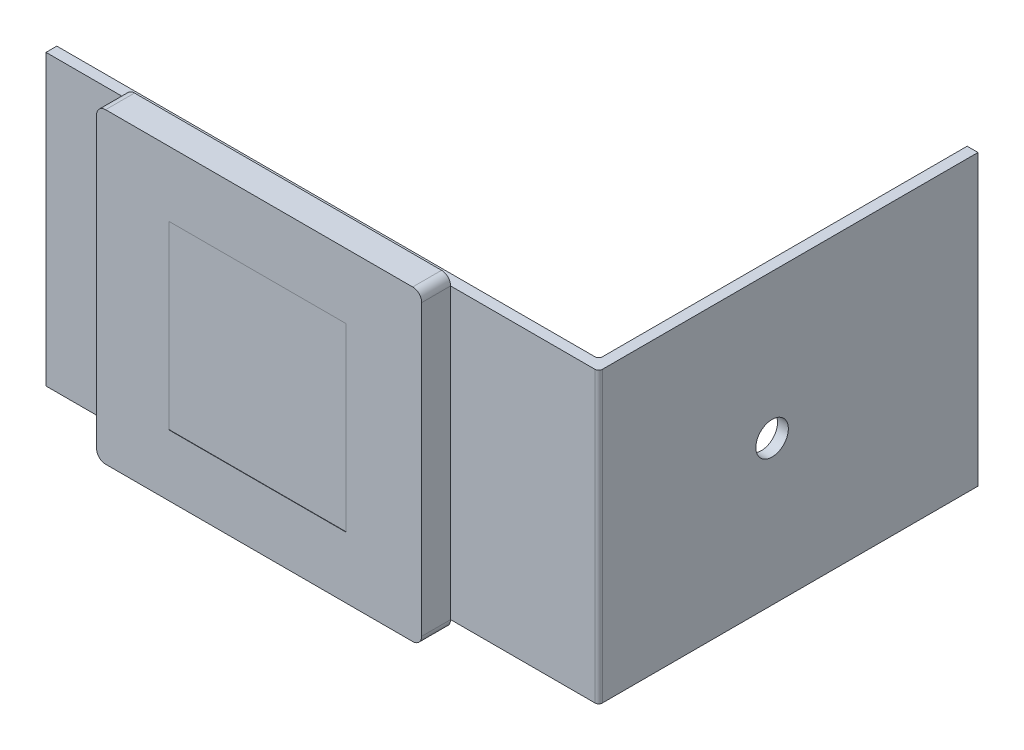
ISO-10303-21;
HEADER;
FILE_DESCRIPTION(('STEP AP214'),'2;1');
FILE_NAME('part.step','',(''),(''),'','','');
FILE_SCHEMA(('AUTOMOTIVE_DESIGN { 1 0 10303 214 1 1 1 1 }'));
ENDSEC;
DATA;
#1=APPLICATION_CONTEXT('core data for automotive mechanical design processes');
#2=APPLICATION_PROTOCOL_DEFINITION('international standard','automotive_design',2000,#1);
#3=PRODUCT_CONTEXT('',#1,'mechanical');
#4=PRODUCT('Part','Part','',(#3));
#5=PRODUCT_RELATED_PRODUCT_CATEGORY('part','',(#4));
#6=PRODUCT_DEFINITION_FORMATION('','',#4);
#7=PRODUCT_DEFINITION_CONTEXT('part definition',#1,'design');
#8=PRODUCT_DEFINITION('design','',#6,#7);
#9=PRODUCT_DEFINITION_SHAPE('','',#8);
#10=(LENGTH_UNIT() NAMED_UNIT(*) SI_UNIT(.MILLI.,.METRE.));
#11=(NAMED_UNIT(*) PLANE_ANGLE_UNIT() SI_UNIT($,.RADIAN.));
#12=(NAMED_UNIT(*) SI_UNIT($,.STERADIAN.) SOLID_ANGLE_UNIT());
#13=UNCERTAINTY_MEASURE_WITH_UNIT(LENGTH_MEASURE(1.E-05),#10,'distance_accuracy_value','');
#14=(GEOMETRIC_REPRESENTATION_CONTEXT(3) GLOBAL_UNCERTAINTY_ASSIGNED_CONTEXT((#13)) GLOBAL_UNIT_ASSIGNED_CONTEXT((#10,
#11,#12)) REPRESENTATION_CONTEXT('',''));
#15=CARTESIAN_POINT('',(0.,0.,0.));
#16=DIRECTION('',(0.,0.,1.));
#17=DIRECTION('',(1.,0.,0.));
#18=AXIS2_PLACEMENT_3D('',#15,#16,#17);
#19=CARTESIAN_POINT('',(-45.2975253991126,0.,18.5838066713091));
#20=DIRECTION('',(0.,0.,1.));
#21=DIRECTION('',(1.,0.,0.));
#22=AXIS2_PLACEMENT_3D('',#19,#20,#21);
#23=PLANE('',#22);
#24=CARTESIAN_POINT('',(-45.2975253991126,0.,18.5838066713091));
#25=DIRECTION('',(0.,0.,1.));
#26=DIRECTION('',(1.,0.,0.));
#27=AXIS2_PLACEMENT_3D('',#24,#25,#26);
#28=CIRCLE('',#27,2.5);
#29=CARTESIAN_POINT('',(-45.2975253991126,-2.5,18.5838066713091));
#30=VERTEX_POINT('',#29);
#31=CARTESIAN_POINT('',(-42.7975253991126,0.,18.5838066713091));
#32=VERTEX_POINT('',#31);
#33=EDGE_CURVE('E225',#30,#32,#28,.T.);
#34=ORIENTED_EDGE('',*,*,#33,.T.);
#35=DIRECTION('',(0.,1.,0.));
#36=VECTOR('',#35,1.);
#37=CARTESIAN_POINT('',(-42.7975253991126,0.,18.5838066713091));
#38=LINE('',#37,#36);
#39=CARTESIAN_POINT('',(-42.7975253991126,80.,18.5838066713091));
#40=VERTEX_POINT('',#39);
#41=EDGE_CURVE('E229',#32,#40,#38,.T.);
#42=ORIENTED_EDGE('',*,*,#41,.T.);
#43=CARTESIAN_POINT('',(-45.2975253991126,80.,18.5838066713091));
#44=DIRECTION('',(0.,0.,1.));
#45=DIRECTION('',(1.,0.,0.));
#46=AXIS2_PLACEMENT_3D('',#43,#44,#45);
#47=CIRCLE('',#46,2.5);
#48=CARTESIAN_POINT('',(-45.2975253991126,82.5,18.5838066713091));
#49=VERTEX_POINT('',#48);
#50=EDGE_CURVE('E233',#40,#49,#47,.T.);
#51=ORIENTED_EDGE('',*,*,#50,.T.);
#52=DIRECTION('',(-1.,0.,0.));
#53=VECTOR('',#52,1.);
#54=CARTESIAN_POINT('',(-45.2975253991126,82.5,18.5838066713091));
#55=LINE('',#54,#53);
#56=CARTESIAN_POINT('',(-130.297525399113,82.5,18.5838066713091));
#57=VERTEX_POINT('',#56);
#58=EDGE_CURVE('E236',#49,#57,#55,.T.);
#59=ORIENTED_EDGE('',*,*,#58,.T.);
#60=CARTESIAN_POINT('',(-130.297525399113,80.,18.5838066713091));
#61=DIRECTION('',(0.,0.,1.));
#62=DIRECTION('',(1.,0.,0.));
#63=AXIS2_PLACEMENT_3D('',#60,#61,#62);
#64=CIRCLE('',#63,2.5);
#65=CARTESIAN_POINT('',(-132.797525399113,80.,18.5838066713091));
#66=VERTEX_POINT('',#65);
#67=EDGE_CURVE('E239',#57,#66,#64,.T.);
#68=ORIENTED_EDGE('',*,*,#67,.T.);
#69=DIRECTION('',(0.,-1.,0.));
#70=VECTOR('',#69,1.);
#71=CARTESIAN_POINT('',(-132.797525399113,0.,18.5838066713091));
#72=LINE('',#71,#70);
#73=CARTESIAN_POINT('',(-132.797525399113,0.,18.5838066713091));
#74=VERTEX_POINT('',#73);
#75=EDGE_CURVE('E242',#66,#74,#72,.T.);
#76=ORIENTED_EDGE('',*,*,#75,.T.);
#77=CARTESIAN_POINT('',(-130.297525399113,0.,18.5838066713091));
#78=DIRECTION('',(0.,0.,1.));
#79=DIRECTION('',(-1.,0.,0.));
#80=AXIS2_PLACEMENT_3D('',#77,#78,#79);
#81=CIRCLE('',#80,2.5);
#82=CARTESIAN_POINT('',(-130.297525399113,-2.50000000000001,18.5838066713091));
#83=VERTEX_POINT('',#82);
#84=EDGE_CURVE('E245',#74,#83,#81,.T.);
#85=ORIENTED_EDGE('',*,*,#84,.T.);
#86=DIRECTION('',(1.,0.,0.));
#87=VECTOR('',#86,1.);
#88=CARTESIAN_POINT('',(-45.2975253991126,-2.5,18.5838066713091));
#89=LINE('',#88,#87);
#90=EDGE_CURVE('E248',#83,#30,#89,.T.);
#91=ORIENTED_EDGE('',*,*,#90,.T.);
#92=EDGE_LOOP('',(#34,#42,#51,#59,#68,#76,#85,#91));
#93=FACE_BOUND('',#92,.T.);
#94=DIRECTION('',(-1.,0.,0.));
#95=VECTOR('',#94,1.);
#96=CARTESIAN_POINT('',(-45.2975253991126,14.5,18.5838066713091));
#97=LINE('',#96,#95);
#98=CARTESIAN_POINT('',(-63.7975253991126,14.5,18.5838066713091));
#99=VERTEX_POINT('',#98);
#100=CARTESIAN_POINT('',(-112.797525399113,14.5,18.5838066713091));
#101=VERTEX_POINT('',#100);
#102=EDGE_CURVE('E50',#99,#101,#97,.T.);
#103=ORIENTED_EDGE('',*,*,#102,.T.);
#104=DIRECTION('',(0.,1.,0.));
#105=VECTOR('',#104,1.);
#106=CARTESIAN_POINT('',(-112.797525399113,0.,18.5838066713091));
#107=LINE('',#106,#105);
#108=CARTESIAN_POINT('',(-112.797525399113,64.5,18.5838066713091));
#109=VERTEX_POINT('',#108);
#110=EDGE_CURVE('E11',#101,#109,#107,.T.);
#111=ORIENTED_EDGE('',*,*,#110,.T.);
#112=DIRECTION('',(-1.,0.,0.));
#113=VECTOR('',#112,1.);
#114=CARTESIAN_POINT('',(-45.2975253991126,64.5,18.5838066713091));
#115=LINE('',#114,#113);
#116=CARTESIAN_POINT('',(-63.7975253991126,64.5,18.5838066713091));
#117=VERTEX_POINT('',#116);
#118=EDGE_CURVE('E398',#117,#109,#115,.T.);
#119=ORIENTED_EDGE('',*,*,#118,.F.);
#120=DIRECTION('',(0.,1.,0.));
#121=VECTOR('',#120,1.);
#122=CARTESIAN_POINT('',(-63.7975253991126,0.,18.5838066713091));
#123=LINE('',#122,#121);
#124=EDGE_CURVE('E401',#99,#117,#123,.T.);
#125=ORIENTED_EDGE('',*,*,#124,.F.);
#126=EDGE_LOOP('',(#103,#111,#119,#125));
#127=FACE_BOUND('',#126,.T.);
#128=ADVANCED_FACE('F41',(#93,#127),#23,.T.);
#129=CARTESIAN_POINT('',(-154.797525399113,80.,10.5838066713091));
#130=DIRECTION('',(0.,0.,-1.));
#131=DIRECTION('',(-1.,0.,0.));
#132=AXIS2_PLACEMENT_3D('',#129,#130,#131);
#133=PLANE('',#132);
#134=DIRECTION('',(0.,1.,0.));
#135=VECTOR('',#134,1.);
#136=CARTESIAN_POINT('',(-42.7975253991126,0.,10.5838066713091));
#137=LINE('',#136,#135);
#138=CARTESIAN_POINT('',(-42.7975253991126,0.,10.5838066713091));
#139=VERTEX_POINT('',#138);
#140=CARTESIAN_POINT('',(-42.7975253991126,80.,10.5838066713091));
#141=VERTEX_POINT('',#140);
#142=EDGE_CURVE('E255',#139,#141,#137,.T.);
#143=ORIENTED_EDGE('',*,*,#142,.F.);
#144=DIRECTION('',(1.,0.,0.));
#145=VECTOR('',#144,1.);
#146=CARTESIAN_POINT('',(-154.797525399113,0.,10.5838066713091));
#147=LINE('',#146,#145);
#148=CARTESIAN_POINT('',(-2.7975253991126,0.,10.5838066713091));
#149=VERTEX_POINT('',#148);
#150=EDGE_CURVE('E347',#139,#149,#147,.T.);
#151=ORIENTED_EDGE('',*,*,#150,.T.);
#152=DIRECTION('',(0.,-1.,0.));
#153=VECTOR('',#152,1.);
#154=CARTESIAN_POINT('',(-2.7975253991126,80.,10.5838066713091));
#155=LINE('',#154,#153);
#156=CARTESIAN_POINT('',(-2.7975253991126,80.,10.5838066713091));
#157=VERTEX_POINT('',#156);
#158=EDGE_CURVE('E386',#157,#149,#155,.T.);
#159=ORIENTED_EDGE('',*,*,#158,.F.);
#160=DIRECTION('',(1.,0.,0.));
#161=VECTOR('',#160,1.);
#162=CARTESIAN_POINT('',(-154.797525399113,80.,10.5838066713091));
#163=LINE('',#162,#161);
#164=EDGE_CURVE('E65',#141,#157,#163,.T.);
#165=ORIENTED_EDGE('',*,*,#164,.F.);
#166=EDGE_LOOP('',(#143,#151,#159,#165));
#167=FACE_BOUND('',#166,.T.);
#168=ADVANCED_FACE('F420',(#167),#133,.F.);
#169=CARTESIAN_POINT('',(-5.79752539911259,80.,7.58380667130908));
#170=DIRECTION('',(0.,0.,1.));
#171=DIRECTION('',(1.,0.,0.));
#172=AXIS2_PLACEMENT_3D('',#169,#170,#171);
#173=PLANE('',#172);
#174=DIRECTION('',(-1.,0.,0.));
#175=VECTOR('',#174,1.);
#176=CARTESIAN_POINT('',(-5.79752539911259,0.,7.58380667130908));
#177=LINE('',#176,#175);
#178=CARTESIAN_POINT('',(-5.79752539911259,0.,7.58380667130908));
#179=VERTEX_POINT('',#178);
#180=CARTESIAN_POINT('',(-154.797525399113,0.,7.5838066713091));
#181=VERTEX_POINT('',#180);
#182=EDGE_CURVE('E312',#179,#181,#177,.T.);
#183=ORIENTED_EDGE('',*,*,#182,.T.);
#184=DIRECTION('',(0.,-1.,0.));
#185=VECTOR('',#184,1.);
#186=CARTESIAN_POINT('',(-154.797525399113,80.,7.5838066713091));
#187=LINE('',#186,#185);
#188=CARTESIAN_POINT('',(-154.797525399113,80.,7.5838066713091));
#189=VERTEX_POINT('',#188);
#190=EDGE_CURVE('E394',#189,#181,#187,.T.);
#191=ORIENTED_EDGE('',*,*,#190,.F.);
#192=DIRECTION('',(-1.,0.,0.));
#193=VECTOR('',#192,1.);
#194=CARTESIAN_POINT('',(-5.79752539911259,80.,7.58380667130908));
#195=LINE('',#194,#193);
#196=CARTESIAN_POINT('',(-5.79752539911259,80.,7.58380667130908));
#197=VERTEX_POINT('',#196);
#198=EDGE_CURVE('E313',#197,#189,#195,.T.);
#199=ORIENTED_EDGE('',*,*,#198,.F.);
#200=DIRECTION('',(0.,-1.,0.));
#201=VECTOR('',#200,1.);
#202=CARTESIAN_POINT('',(-5.79752539911259,80.,7.58380667130908));
#203=LINE('',#202,#201);
#204=EDGE_CURVE('E340',#197,#179,#203,.T.);
#205=ORIENTED_EDGE('',*,*,#204,.T.);
#206=EDGE_LOOP('',(#183,#191,#199,#205));
#207=FACE_BOUND('',#206,.T.);
#208=ADVANCED_FACE('F43',(#207),#173,.F.);
#209=CARTESIAN_POINT('',(-154.797525399113,80.,7.5838066713091));
#210=DIRECTION('',(1.,0.,0.));
#211=DIRECTION('',(0.,0.,-1.));
#212=AXIS2_PLACEMENT_3D('',#209,#210,#211);
#213=PLANE('',#212);
#214=DIRECTION('',(0.,0.,1.));
#215=VECTOR('',#214,1.);
#216=CARTESIAN_POINT('',(-154.797525399113,0.,7.5838066713091));
#217=LINE('',#216,#215);
#218=CARTESIAN_POINT('',(-154.797525399113,0.,10.5838066713091));
#219=VERTEX_POINT('',#218);
#220=EDGE_CURVE('E344',#181,#219,#217,.T.);
#221=ORIENTED_EDGE('',*,*,#220,.T.);
#222=DIRECTION('',(0.,-1.,0.));
#223=VECTOR('',#222,1.);
#224=CARTESIAN_POINT('',(-154.797525399113,80.,10.5838066713091));
#225=LINE('',#224,#223);
#226=CARTESIAN_POINT('',(-154.797525399113,80.,10.5838066713091));
#227=VERTEX_POINT('',#226);
#228=EDGE_CURVE('E390',#227,#219,#225,.T.);
#229=ORIENTED_EDGE('',*,*,#228,.F.);
#230=DIRECTION('',(0.,0.,1.));
#231=VECTOR('',#230,1.);
#232=CARTESIAN_POINT('',(-154.797525399113,80.,7.5838066713091));
#233=LINE('',#232,#231);
#234=EDGE_CURVE('E317',#189,#227,#233,.T.);
#235=ORIENTED_EDGE('',*,*,#234,.F.);
#236=ORIENTED_EDGE('',*,*,#190,.T.);
#237=EDGE_LOOP('',(#221,#229,#235,#236));
#238=FACE_BOUND('',#237,.T.);
#239=ADVANCED_FACE('F496',(#238),#213,.F.);
#240=DIRECTION('',(0.,-1.,0.));
#241=VECTOR('',#240,1.);
#242=CARTESIAN_POINT('',(-132.797525399113,0.,10.5838066713091));
#243=LINE('',#242,#241);
#244=CARTESIAN_POINT('',(-132.797525399113,80.,10.5838066713091));
#245=VERTEX_POINT('',#244);
#246=CARTESIAN_POINT('',(-132.797525399113,0.,10.5838066713091));
#247=VERTEX_POINT('',#246);
#248=EDGE_CURVE('E269',#245,#247,#243,.T.);
#249=ORIENTED_EDGE('',*,*,#248,.F.);
#250=EDGE_CURVE('E321',#227,#245,#163,.T.);
#251=ORIENTED_EDGE('',*,*,#250,.F.);
#252=ORIENTED_EDGE('',*,*,#228,.T.);
#253=EDGE_CURVE('E348',#219,#247,#147,.T.);
#254=ORIENTED_EDGE('',*,*,#253,.T.);
#255=EDGE_LOOP('',(#249,#251,#252,#254));
#256=FACE_BOUND('',#255,.T.);
#257=ADVANCED_FACE('F427',(#256),#133,.F.);
#258=CARTESIAN_POINT('',(-2.7975253991126,80.,9.58380667130909));
#259=DIRECTION('',(0.,-1.,0.));
#260=DIRECTION('',(0.,0.,-1.));
#261=AXIS2_PLACEMENT_3D('',#258,#259,#260);
#262=CYLINDRICAL_SURFACE('',#261,1.);
#263=CARTESIAN_POINT('',(-2.7975253991126,0.,9.58380667130909));
#264=DIRECTION('',(0.,1.,0.));
#265=DIRECTION('',(0.,0.,1.));
#266=AXIS2_PLACEMENT_3D('',#263,#264,#265);
#267=CIRCLE('',#266,1.);
#268=CARTESIAN_POINT('',(-1.7975253991126,0.,9.58380667130909));
#269=VERTEX_POINT('',#268);
#270=EDGE_CURVE('E352',#149,#269,#267,.T.);
#271=ORIENTED_EDGE('',*,*,#270,.T.);
#272=DIRECTION('',(0.,-1.,0.));
#273=VECTOR('',#272,1.);
#274=CARTESIAN_POINT('',(-1.7975253991126,80.,9.58380667130909));
#275=LINE('',#274,#273);
#276=CARTESIAN_POINT('',(-1.7975253991126,80.,9.58380667130909));
#277=VERTEX_POINT('',#276);
#278=EDGE_CURVE('E382',#277,#269,#275,.T.);
#279=ORIENTED_EDGE('',*,*,#278,.F.);
#280=CARTESIAN_POINT('',(-2.7975253991126,80.,9.58380667130909));
#281=DIRECTION('',(0.,1.,0.));
#282=DIRECTION('',(0.,0.,1.));
#283=AXIS2_PLACEMENT_3D('',#280,#281,#282);
#284=CIRCLE('',#283,1.);
#285=EDGE_CURVE('E325',#157,#277,#284,.T.);
#286=ORIENTED_EDGE('',*,*,#285,.F.);
#287=ORIENTED_EDGE('',*,*,#158,.T.);
#288=EDGE_LOOP('',(#271,#279,#286,#287));
#289=FACE_BOUND('',#288,.T.);
#290=ADVANCED_FACE('F491',(#289),#262,.T.);
#291=CARTESIAN_POINT('',(-1.7975253991126,80.,9.58380667130909));
#292=DIRECTION('',(-1.,0.,0.));
#293=DIRECTION('',(0.,0.,1.));
#294=AXIS2_PLACEMENT_3D('',#291,#292,#293);
#295=PLANE('',#294);
#296=CARTESIAN_POINT('',(-1.7975253991126,40.,-37.4161933286909));
#297=DIRECTION('',(1.,0.,0.));
#298=DIRECTION('',(0.,0.,-1.));
#299=AXIS2_PLACEMENT_3D('',#296,#297,#298);
#300=CIRCLE('',#299,4.49999999999999);
#301=CARTESIAN_POINT('',(-1.7975253991126,40.,-41.9161933286909));
#302=VERTEX_POINT('',#301);
#303=EDGE_CURVE('E210',#302,#302,#300,.T.);
#304=ORIENTED_EDGE('',*,*,#303,.F.);
#305=EDGE_LOOP('',(#304));
#306=FACE_BOUND('',#305,.T.);
#307=DIRECTION('',(0.,0.,-1.));
#308=VECTOR('',#307,1.);
#309=CARTESIAN_POINT('',(-1.7975253991126,0.,9.58380667130909));
#310=LINE('',#309,#308);
#311=CARTESIAN_POINT('',(-1.7975253991126,0.,-94.4161933286909));
#312=VERTEX_POINT('',#311);
#313=EDGE_CURVE('E356',#269,#312,#310,.T.);
#314=ORIENTED_EDGE('',*,*,#313,.T.);
#315=DIRECTION('',(0.,-1.,0.));
#316=VECTOR('',#315,1.);
#317=CARTESIAN_POINT('',(-1.7975253991126,80.,-94.4161933286909));
#318=LINE('',#317,#316);
#319=CARTESIAN_POINT('',(-1.7975253991126,80.,-94.4161933286909));
#320=VERTEX_POINT('',#319);
#321=EDGE_CURVE('E378',#320,#312,#318,.T.);
#322=ORIENTED_EDGE('',*,*,#321,.F.);
#323=DIRECTION('',(0.,0.,-1.));
#324=VECTOR('',#323,1.);
#325=CARTESIAN_POINT('',(-1.7975253991126,80.,9.58380667130909));
#326=LINE('',#325,#324);
#327=EDGE_CURVE('E328',#277,#320,#326,.T.);
#328=ORIENTED_EDGE('',*,*,#327,.F.);
#329=ORIENTED_EDGE('',*,*,#278,.T.);
#330=EDGE_LOOP('',(#314,#322,#328,#329));
#331=FACE_BOUND('',#330,.T.);
#332=ADVANCED_FACE('F487',(#306,#331),#295,.F.);
#333=CARTESIAN_POINT('',(-1.7975253991126,80.,-94.4161933286909));
#334=DIRECTION('',(0.,0.,1.));
#335=DIRECTION('',(1.,0.,0.));
#336=AXIS2_PLACEMENT_3D('',#333,#334,#335);
#337=PLANE('',#336);
#338=DIRECTION('',(-1.,0.,0.));
#339=VECTOR('',#338,1.);
#340=CARTESIAN_POINT('',(-1.7975253991126,0.,-94.4161933286909));
#341=LINE('',#340,#339);
#342=CARTESIAN_POINT('',(-4.7975253991126,0.,-94.4161933286909));
#343=VERTEX_POINT('',#342);
#344=EDGE_CURVE('E359',#312,#343,#341,.T.);
#345=ORIENTED_EDGE('',*,*,#344,.T.);
#346=DIRECTION('',(0.,-1.,0.));
#347=VECTOR('',#346,1.);
#348=CARTESIAN_POINT('',(-4.7975253991126,80.,-94.4161933286909));
#349=LINE('',#348,#347);
#350=CARTESIAN_POINT('',(-4.7975253991126,80.,-94.4161933286909));
#351=VERTEX_POINT('',#350);
#352=EDGE_CURVE('E374',#351,#343,#349,.T.);
#353=ORIENTED_EDGE('',*,*,#352,.F.);
#354=DIRECTION('',(-1.,0.,0.));
#355=VECTOR('',#354,1.);
#356=CARTESIAN_POINT('',(-1.7975253991126,80.,-94.4161933286909));
#357=LINE('',#356,#355);
#358=EDGE_CURVE('E331',#320,#351,#357,.T.);
#359=ORIENTED_EDGE('',*,*,#358,.F.);
#360=ORIENTED_EDGE('',*,*,#321,.T.);
#361=EDGE_LOOP('',(#345,#353,#359,#360));
#362=FACE_BOUND('',#361,.T.);
#363=ADVANCED_FACE('F483',(#362),#337,.F.);
#364=CARTESIAN_POINT('',(-4.7975253991126,80.,-94.4161933286909));
#365=DIRECTION('',(1.,0.,0.));
#366=DIRECTION('',(0.,0.,-1.));
#367=AXIS2_PLACEMENT_3D('',#364,#365,#366);
#368=PLANE('',#367);
#369=CARTESIAN_POINT('',(-4.7975253991126,40.,-37.4161933286909));
#370=DIRECTION('',(1.,0.,0.));
#371=DIRECTION('',(0.,0.,-1.));
#372=AXIS2_PLACEMENT_3D('',#369,#370,#371);
#373=CIRCLE('',#372,4.49999999999999);
#374=CARTESIAN_POINT('',(-4.7975253991126,40.,-41.9161933286909));
#375=VERTEX_POINT('',#374);
#376=EDGE_CURVE('E206',#375,#375,#373,.F.);
#377=ORIENTED_EDGE('',*,*,#376,.F.);
#378=EDGE_LOOP('',(#377));
#379=FACE_BOUND('',#378,.T.);
#380=DIRECTION('',(0.,0.,1.));
#381=VECTOR('',#380,1.);
#382=CARTESIAN_POINT('',(-4.7975253991126,0.,-94.4161933286909));
#383=LINE('',#382,#381);
#384=CARTESIAN_POINT('',(-4.79752539911259,0.,6.58380667130908));
#385=VERTEX_POINT('',#384);
#386=EDGE_CURVE('E362',#343,#385,#383,.T.);
#387=ORIENTED_EDGE('',*,*,#386,.T.);
#388=DIRECTION('',(0.,-1.,0.));
#389=VECTOR('',#388,1.);
#390=CARTESIAN_POINT('',(-4.79752539911259,80.,6.58380667130908));
#391=LINE('',#390,#389);
#392=CARTESIAN_POINT('',(-4.79752539911259,80.,6.58380667130908));
#393=VERTEX_POINT('',#392);
#394=EDGE_CURVE('E370',#393,#385,#391,.T.);
#395=ORIENTED_EDGE('',*,*,#394,.F.);
#396=DIRECTION('',(0.,0.,1.));
#397=VECTOR('',#396,1.);
#398=CARTESIAN_POINT('',(-4.7975253991126,80.,-94.4161933286909));
#399=LINE('',#398,#397);
#400=EDGE_CURVE('E334',#351,#393,#399,.T.);
#401=ORIENTED_EDGE('',*,*,#400,.F.);
#402=ORIENTED_EDGE('',*,*,#352,.T.);
#403=EDGE_LOOP('',(#387,#395,#401,#402));
#404=FACE_BOUND('',#403,.T.);
#405=ADVANCED_FACE('F479',(#379,#404),#368,.F.);
#406=CARTESIAN_POINT('',(-5.79752539911259,80.,6.58380667130908));
#407=DIRECTION('',(0.,-1.,0.));
#408=DIRECTION('',(0.,0.,-1.));
#409=AXIS2_PLACEMENT_3D('',#406,#407,#408);
#410=CYLINDRICAL_SURFACE('',#409,1.);
#411=CARTESIAN_POINT('',(-5.79752539911259,0.,6.58380667130908));
#412=DIRECTION('',(0.,-1.,0.));
#413=DIRECTION('',(0.,0.,-1.));
#414=AXIS2_PLACEMENT_3D('',#411,#412,#413);
#415=CIRCLE('',#414,1.);
#416=EDGE_CURVE('E318',#385,#179,#415,.T.);
#417=ORIENTED_EDGE('',*,*,#416,.T.);
#418=ORIENTED_EDGE('',*,*,#204,.F.);
#419=CARTESIAN_POINT('',(-5.79752539911259,80.,6.58380667130908));
#420=DIRECTION('',(0.,-1.,0.));
#421=DIRECTION('',(0.,0.,-1.));
#422=AXIS2_PLACEMENT_3D('',#419,#420,#421);
#423=CIRCLE('',#422,1.);
#424=EDGE_CURVE('E337',#393,#197,#423,.T.);
#425=ORIENTED_EDGE('',*,*,#424,.F.);
#426=ORIENTED_EDGE('',*,*,#394,.T.);
#427=EDGE_LOOP('',(#417,#418,#425,#426));
#428=FACE_BOUND('',#427,.T.);
#429=ADVANCED_FACE('F472',(#428),#410,.F.);
#430=CARTESIAN_POINT('',(-2.7975253991126,80.,9.58380667130909));
#431=DIRECTION('',(0.,1.,0.));
#432=DIRECTION('',(0.,0.,1.));
#433=AXIS2_PLACEMENT_3D('',#430,#431,#432);
#434=PLANE('',#433);
#435=ORIENTED_EDGE('',*,*,#198,.T.);
#436=ORIENTED_EDGE('',*,*,#234,.T.);
#437=ORIENTED_EDGE('',*,*,#250,.T.);
#438=DIRECTION('',(1.,0.,0.));
#439=VECTOR('',#438,1.);
#440=CARTESIAN_POINT('',(-2.7975253991126,80.,10.5838066713091));
#441=LINE('',#440,#439);
#442=EDGE_CURVE('E309',#245,#141,#441,.T.);
#443=ORIENTED_EDGE('',*,*,#442,.T.);
#444=ORIENTED_EDGE('',*,*,#164,.T.);
#445=ORIENTED_EDGE('',*,*,#285,.T.);
#446=ORIENTED_EDGE('',*,*,#327,.T.);
#447=ORIENTED_EDGE('',*,*,#358,.T.);
#448=ORIENTED_EDGE('',*,*,#400,.T.);
#449=ORIENTED_EDGE('',*,*,#424,.T.);
#450=EDGE_LOOP('',(#435,#436,#437,#443,#444,#445,#446,#447,#448,#449));
#451=FACE_BOUND('',#450,.T.);
#452=ADVANCED_FACE('F468',(#451),#434,.T.);
#453=CARTESIAN_POINT('',(-2.7975253991126,0.,9.58380667130909));
#454=DIRECTION('',(0.,1.,0.));
#455=DIRECTION('',(0.,0.,1.));
#456=AXIS2_PLACEMENT_3D('',#453,#454,#455);
#457=PLANE('',#456);
#458=ORIENTED_EDGE('',*,*,#182,.F.);
#459=ORIENTED_EDGE('',*,*,#416,.F.);
#460=ORIENTED_EDGE('',*,*,#386,.F.);
#461=ORIENTED_EDGE('',*,*,#344,.F.);
#462=ORIENTED_EDGE('',*,*,#313,.F.);
#463=ORIENTED_EDGE('',*,*,#270,.F.);
#464=ORIENTED_EDGE('',*,*,#150,.F.);
#465=EDGE_CURVE('E353',#247,#139,#147,.T.);
#466=ORIENTED_EDGE('',*,*,#465,.F.);
#467=ORIENTED_EDGE('',*,*,#253,.F.);
#468=ORIENTED_EDGE('',*,*,#220,.F.);
#469=EDGE_LOOP('',(#458,#459,#460,#461,#462,#463,#464,#466,#467,#468));
#470=FACE_BOUND('',#469,.T.);
#471=ADVANCED_FACE('F471',(#470),#457,.F.);
#472=CARTESIAN_POINT('',(-45.2975253991126,0.,10.5838066713091));
#473=DIRECTION('',(0.,0.,1.));
#474=DIRECTION('',(1.,0.,0.));
#475=AXIS2_PLACEMENT_3D('',#472,#473,#474);
#476=PLANE('',#475);
#477=CARTESIAN_POINT('',(-130.297525399113,0.,10.5838066713091));
#478=DIRECTION('',(0.,0.,1.));
#479=DIRECTION('',(-1.,0.,0.));
#480=AXIS2_PLACEMENT_3D('',#477,#478,#479);
#481=CIRCLE('',#480,2.5);
#482=CARTESIAN_POINT('',(-130.297525399113,-2.50000000000001,10.5838066713091));
#483=VERTEX_POINT('',#482);
#484=EDGE_CURVE('E273',#247,#483,#481,.T.);
#485=ORIENTED_EDGE('',*,*,#484,.F.);
#486=ORIENTED_EDGE('',*,*,#465,.T.);
#487=CARTESIAN_POINT('',(-45.2975253991126,0.,10.5838066713091));
#488=DIRECTION('',(0.,0.,1.));
#489=DIRECTION('',(1.,0.,0.));
#490=AXIS2_PLACEMENT_3D('',#487,#488,#489);
#491=CIRCLE('',#490,2.5);
#492=CARTESIAN_POINT('',(-45.2975253991126,-2.5,10.5838066713091));
#493=VERTEX_POINT('',#492);
#494=EDGE_CURVE('E189',#493,#139,#491,.T.);
#495=ORIENTED_EDGE('',*,*,#494,.F.);
#496=DIRECTION('',(1.,0.,0.));
#497=VECTOR('',#496,1.);
#498=CARTESIAN_POINT('',(-45.2975253991126,-2.5,10.5838066713091));
#499=LINE('',#498,#497);
#500=EDGE_CURVE('E230',#483,#493,#499,.T.);
#501=ORIENTED_EDGE('',*,*,#500,.F.);
#502=EDGE_LOOP('',(#485,#486,#495,#501));
#503=FACE_BOUND('',#502,.T.);
#504=ADVANCED_FACE('F436',(#503),#476,.F.);
#505=CARTESIAN_POINT('',(-45.2975253991126,0.,18.5838066713091));
#506=DIRECTION('',(0.,0.,-1.));
#507=DIRECTION('',(-1.,0.,0.));
#508=AXIS2_PLACEMENT_3D('',#505,#506,#507);
#509=CYLINDRICAL_SURFACE('',#508,2.5);
#510=ORIENTED_EDGE('',*,*,#494,.T.);
#511=DIRECTION('',(0.,0.,-1.));
#512=VECTOR('',#511,1.);
#513=CARTESIAN_POINT('',(-42.7975253991126,0.,18.5838066713091));
#514=LINE('',#513,#512);
#515=EDGE_CURVE('E305',#32,#139,#514,.T.);
#516=ORIENTED_EDGE('',*,*,#515,.F.);
#517=ORIENTED_EDGE('',*,*,#33,.F.);
#518=DIRECTION('',(0.,0.,-1.));
#519=VECTOR('',#518,1.);
#520=CARTESIAN_POINT('',(-45.2975253991126,-2.5,18.5838066713091));
#521=LINE('',#520,#519);
#522=EDGE_CURVE('E251',#30,#493,#521,.T.);
#523=ORIENTED_EDGE('',*,*,#522,.T.);
#524=EDGE_LOOP('',(#510,#516,#517,#523));
#525=FACE_BOUND('',#524,.T.);
#526=ADVANCED_FACE('F463',(#525),#509,.T.);
#527=CARTESIAN_POINT('',(-42.7975253991126,0.,18.5838066713091));
#528=DIRECTION('',(-1.,0.,0.));
#529=DIRECTION('',(0.,-1.,0.));
#530=AXIS2_PLACEMENT_3D('',#527,#528,#529);
#531=PLANE('',#530);
#532=ORIENTED_EDGE('',*,*,#142,.T.);
#533=DIRECTION('',(0.,0.,-1.));
#534=VECTOR('',#533,1.);
#535=CARTESIAN_POINT('',(-42.7975253991126,80.,18.5838066713091));
#536=LINE('',#535,#534);
#537=EDGE_CURVE('E301',#40,#141,#536,.T.);
#538=ORIENTED_EDGE('',*,*,#537,.F.);
#539=ORIENTED_EDGE('',*,*,#41,.F.);
#540=ORIENTED_EDGE('',*,*,#515,.T.);
#541=EDGE_LOOP('',(#532,#538,#539,#540));
#542=FACE_BOUND('',#541,.T.);
#543=ADVANCED_FACE('F459',(#542),#531,.F.);
#544=CARTESIAN_POINT('',(-45.2975253991126,80.,18.5838066713091));
#545=DIRECTION('',(0.,0.,-1.));
#546=DIRECTION('',(-1.,0.,0.));
#547=AXIS2_PLACEMENT_3D('',#544,#545,#546);
#548=CYLINDRICAL_SURFACE('',#547,2.5);
#549=CARTESIAN_POINT('',(-45.2975253991126,80.,10.5838066713091));
#550=DIRECTION('',(0.,0.,1.));
#551=DIRECTION('',(1.,0.,0.));
#552=AXIS2_PLACEMENT_3D('',#549,#550,#551);
#553=CIRCLE('',#552,2.5);
#554=CARTESIAN_POINT('',(-45.2975253991126,82.5,10.5838066713091));
#555=VERTEX_POINT('',#554);
#556=EDGE_CURVE('E259',#141,#555,#553,.T.);
#557=ORIENTED_EDGE('',*,*,#556,.T.);
#558=DIRECTION('',(0.,0.,-1.));
#559=VECTOR('',#558,1.);
#560=CARTESIAN_POINT('',(-45.2975253991126,82.5,18.5838066713091));
#561=LINE('',#560,#559);
#562=EDGE_CURVE('E297',#49,#555,#561,.T.);
#563=ORIENTED_EDGE('',*,*,#562,.F.);
#564=ORIENTED_EDGE('',*,*,#50,.F.);
#565=ORIENTED_EDGE('',*,*,#537,.T.);
#566=EDGE_LOOP('',(#557,#563,#564,#565));
#567=FACE_BOUND('',#566,.T.);
#568=ADVANCED_FACE('F455',(#567),#548,.T.);
#569=CARTESIAN_POINT('',(-45.2975253991126,82.5,18.5838066713091));
#570=DIRECTION('',(0.,-1.,0.));
#571=DIRECTION('',(1.,0.,0.));
#572=AXIS2_PLACEMENT_3D('',#569,#570,#571);
#573=PLANE('',#572);
#574=DIRECTION('',(-1.,0.,0.));
#575=VECTOR('',#574,1.);
#576=CARTESIAN_POINT('',(-45.2975253991126,82.5,10.5838066713091));
#577=LINE('',#576,#575);
#578=CARTESIAN_POINT('',(-130.297525399113,82.5,10.5838066713091));
#579=VERTEX_POINT('',#578);
#580=EDGE_CURVE('E262',#555,#579,#577,.T.);
#581=ORIENTED_EDGE('',*,*,#580,.T.);
#582=DIRECTION('',(0.,0.,-1.));
#583=VECTOR('',#582,1.);
#584=CARTESIAN_POINT('',(-130.297525399113,82.5,18.5838066713091));
#585=LINE('',#584,#583);
#586=EDGE_CURVE('E293',#57,#579,#585,.T.);
#587=ORIENTED_EDGE('',*,*,#586,.F.);
#588=ORIENTED_EDGE('',*,*,#58,.F.);
#589=ORIENTED_EDGE('',*,*,#562,.T.);
#590=EDGE_LOOP('',(#581,#587,#588,#589));
#591=FACE_BOUND('',#590,.T.);
#592=ADVANCED_FACE('F451',(#591),#573,.F.);
#593=CARTESIAN_POINT('',(-130.297525399113,80.,18.5838066713091));
#594=DIRECTION('',(0.,0.,-1.));
#595=DIRECTION('',(-1.,0.,0.));
#596=AXIS2_PLACEMENT_3D('',#593,#594,#595);
#597=CYLINDRICAL_SURFACE('',#596,2.5);
#598=CARTESIAN_POINT('',(-130.297525399113,80.,10.5838066713091));
#599=DIRECTION('',(0.,0.,1.));
#600=DIRECTION('',(1.,0.,0.));
#601=AXIS2_PLACEMENT_3D('',#598,#599,#600);
#602=CIRCLE('',#601,2.5);
#603=EDGE_CURVE('E265',#579,#245,#602,.T.);
#604=ORIENTED_EDGE('',*,*,#603,.T.);
#605=DIRECTION('',(0.,0.,-1.));
#606=VECTOR('',#605,1.);
#607=CARTESIAN_POINT('',(-132.797525399113,80.,18.5838066713091));
#608=LINE('',#607,#606);
#609=EDGE_CURVE('E289',#66,#245,#608,.T.);
#610=ORIENTED_EDGE('',*,*,#609,.F.);
#611=ORIENTED_EDGE('',*,*,#67,.F.);
#612=ORIENTED_EDGE('',*,*,#586,.T.);
#613=EDGE_LOOP('',(#604,#610,#611,#612));
#614=FACE_BOUND('',#613,.T.);
#615=ADVANCED_FACE('F447',(#614),#597,.T.);
#616=CARTESIAN_POINT('',(-132.797525399113,0.,18.5838066713091));
#617=DIRECTION('',(1.,0.,0.));
#618=DIRECTION('',(0.,0.,-1.));
#619=AXIS2_PLACEMENT_3D('',#616,#617,#618);
#620=PLANE('',#619);
#621=ORIENTED_EDGE('',*,*,#248,.T.);
#622=DIRECTION('',(0.,0.,-1.));
#623=VECTOR('',#622,1.);
#624=CARTESIAN_POINT('',(-132.797525399113,0.,18.5838066713091));
#625=LINE('',#624,#623);
#626=EDGE_CURVE('E285',#74,#247,#625,.T.);
#627=ORIENTED_EDGE('',*,*,#626,.F.);
#628=ORIENTED_EDGE('',*,*,#75,.F.);
#629=ORIENTED_EDGE('',*,*,#609,.T.);
#630=EDGE_LOOP('',(#621,#627,#628,#629));
#631=FACE_BOUND('',#630,.T.);
#632=ADVANCED_FACE('F443',(#631),#620,.F.);
#633=CARTESIAN_POINT('',(-130.297525399113,0.,18.5838066713091));
#634=DIRECTION('',(0.,0.,-1.));
#635=DIRECTION('',(-1.,0.,0.));
#636=AXIS2_PLACEMENT_3D('',#633,#634,#635);
#637=CYLINDRICAL_SURFACE('',#636,2.5);
#638=ORIENTED_EDGE('',*,*,#484,.T.);
#639=DIRECTION('',(0.,0.,-1.));
#640=VECTOR('',#639,1.);
#641=CARTESIAN_POINT('',(-130.297525399113,-2.50000000000001,18.5838066713091));
#642=LINE('',#641,#640);
#643=EDGE_CURVE('E281',#83,#483,#642,.T.);
#644=ORIENTED_EDGE('',*,*,#643,.F.);
#645=ORIENTED_EDGE('',*,*,#84,.F.);
#646=ORIENTED_EDGE('',*,*,#626,.T.);
#647=EDGE_LOOP('',(#638,#644,#645,#646));
#648=FACE_BOUND('',#647,.T.);
#649=ADVANCED_FACE('F439',(#648),#637,.T.);
#650=CARTESIAN_POINT('',(-45.2975253991126,-2.5,18.5838066713091));
#651=DIRECTION('',(0.,1.,0.));
#652=DIRECTION('',(-1.,0.,0.));
#653=AXIS2_PLACEMENT_3D('',#650,#651,#652);
#654=PLANE('',#653);
#655=ORIENTED_EDGE('',*,*,#500,.T.);
#656=ORIENTED_EDGE('',*,*,#522,.F.);
#657=ORIENTED_EDGE('',*,*,#90,.F.);
#658=ORIENTED_EDGE('',*,*,#643,.T.);
#659=EDGE_LOOP('',(#655,#656,#657,#658));
#660=FACE_BOUND('',#659,.T.);
#661=ADVANCED_FACE('F434',(#660),#654,.F.);
#662=ORIENTED_EDGE('',*,*,#442,.F.);
#663=ORIENTED_EDGE('',*,*,#603,.F.);
#664=ORIENTED_EDGE('',*,*,#580,.F.);
#665=ORIENTED_EDGE('',*,*,#556,.F.);
#666=EDGE_LOOP('',(#662,#663,#664,#665));
#667=FACE_BOUND('',#666,.T.);
#668=ADVANCED_FACE('F431',(#667),#476,.F.);
#669=CARTESIAN_POINT('',(-112.797525399113,64.5,19.0838066713091));
#670=DIRECTION('',(1.,0.,0.));
#671=DIRECTION('',(0.,0.,-1.));
#672=AXIS2_PLACEMENT_3D('',#669,#670,#671);
#673=PLANE('',#672);
#674=DIRECTION('',(0.,0.,-1.));
#675=VECTOR('',#674,1.);
#676=CARTESIAN_POINT('',(-112.797525399113,14.5,19.0838066713091));
#677=LINE('',#676,#675);
#678=CARTESIAN_POINT('',(-112.797525399113,14.5,18.4838066713091));
#679=VERTEX_POINT('',#678);
#680=EDGE_CURVE('E180',#101,#679,#677,.T.);
#681=ORIENTED_EDGE('',*,*,#680,.T.);
#682=DIRECTION('',(0.,-1.,0.));
#683=VECTOR('',#682,1.);
#684=CARTESIAN_POINT('',(-112.797525399113,64.5,18.4838066713091));
#685=LINE('',#684,#683);
#686=CARTESIAN_POINT('',(-112.797525399113,64.5,18.4838066713091));
#687=VERTEX_POINT('',#686);
#688=EDGE_CURVE('E185',#687,#679,#685,.T.);
#689=ORIENTED_EDGE('',*,*,#688,.F.);
#690=DIRECTION('',(0.,0.,-1.));
#691=VECTOR('',#690,1.);
#692=CARTESIAN_POINT('',(-112.797525399113,64.5,19.0838066713091));
#693=LINE('',#692,#691);
#694=EDGE_CURVE('E218',#109,#687,#693,.T.);
#695=ORIENTED_EDGE('',*,*,#694,.F.);
#696=ORIENTED_EDGE('',*,*,#110,.F.);
#697=EDGE_LOOP('',(#681,#689,#695,#696));
#698=FACE_BOUND('',#697,.T.);
#699=ADVANCED_FACE('F182',(#698),#673,.T.);
#700=CARTESIAN_POINT('',(-112.797525399113,14.5,19.0838066713091));
#701=DIRECTION('',(0.,1.,0.));
#702=DIRECTION('',(-1.,0.,0.));
#703=AXIS2_PLACEMENT_3D('',#700,#701,#702);
#704=PLANE('',#703);
#705=DIRECTION('',(0.,0.,-1.));
#706=VECTOR('',#705,1.);
#707=CARTESIAN_POINT('',(-63.7975253991126,14.5,19.0838066713091));
#708=LINE('',#707,#706);
#709=CARTESIAN_POINT('',(-63.7975253991126,14.5,18.4838066713091));
#710=VERTEX_POINT('',#709);
#711=EDGE_CURVE('E190',#99,#710,#708,.T.);
#712=ORIENTED_EDGE('',*,*,#711,.T.);
#713=DIRECTION('',(1.,0.,0.));
#714=VECTOR('',#713,1.);
#715=CARTESIAN_POINT('',(-112.797525399113,14.5,18.4838066713091));
#716=LINE('',#715,#714);
#717=EDGE_CURVE('E193',#679,#710,#716,.T.);
#718=ORIENTED_EDGE('',*,*,#717,.F.);
#719=ORIENTED_EDGE('',*,*,#680,.F.);
#720=ORIENTED_EDGE('',*,*,#102,.F.);
#721=EDGE_LOOP('',(#712,#718,#719,#720));
#722=FACE_BOUND('',#721,.T.);
#723=ADVANCED_FACE('F194',(#722),#704,.T.);
#724=CARTESIAN_POINT('',(-63.7975253991126,64.5,19.0838066713091));
#725=DIRECTION('',(1.,0.,0.));
#726=DIRECTION('',(0.,1.,0.));
#727=AXIS2_PLACEMENT_3D('',#724,#725,#726);
#728=PLANE('',#727);
#729=ORIENTED_EDGE('',*,*,#124,.T.);
#730=DIRECTION('',(0.,0.,-1.));
#731=VECTOR('',#730,1.);
#732=CARTESIAN_POINT('',(-63.7975253991126,64.5,19.0838066713091));
#733=LINE('',#732,#731);
#734=CARTESIAN_POINT('',(-63.7975253991126,64.5,18.4838066713091));
#735=VERTEX_POINT('',#734);
#736=EDGE_CURVE('E57',#117,#735,#733,.T.);
#737=ORIENTED_EDGE('',*,*,#736,.T.);
#738=DIRECTION('',(0.,-1.,0.));
#739=VECTOR('',#738,1.);
#740=CARTESIAN_POINT('',(-63.7975253991126,64.5,18.4838066713091));
#741=LINE('',#740,#739);
#742=EDGE_CURVE('E200',#735,#710,#741,.T.);
#743=ORIENTED_EDGE('',*,*,#742,.T.);
#744=ORIENTED_EDGE('',*,*,#711,.F.);
#745=EDGE_LOOP('',(#729,#737,#743,#744));
#746=FACE_BOUND('',#745,.T.);
#747=ADVANCED_FACE('F408',(#746),#728,.F.);
#748=CARTESIAN_POINT('',(-112.797525399113,64.5,19.0838066713091));
#749=DIRECTION('',(0.,1.,0.));
#750=DIRECTION('',(0.,0.,1.));
#751=AXIS2_PLACEMENT_3D('',#748,#749,#750);
#752=PLANE('',#751);
#753=ORIENTED_EDGE('',*,*,#118,.T.);
#754=ORIENTED_EDGE('',*,*,#694,.T.);
#755=DIRECTION('',(1.,0.,0.));
#756=VECTOR('',#755,1.);
#757=CARTESIAN_POINT('',(-112.797525399113,64.5,18.4838066713091));
#758=LINE('',#757,#756);
#759=EDGE_CURVE('E204',#687,#735,#758,.T.);
#760=ORIENTED_EDGE('',*,*,#759,.T.);
#761=ORIENTED_EDGE('',*,*,#736,.F.);
#762=EDGE_LOOP('',(#753,#754,#760,#761));
#763=FACE_BOUND('',#762,.T.);
#764=ADVANCED_FACE('F409',(#763),#752,.F.);
#765=CARTESIAN_POINT('',(0.,0.,18.4838066713091));
#766=DIRECTION('',(0.,0.,1.));
#767=DIRECTION('',(1.,0.,0.));
#768=AXIS2_PLACEMENT_3D('',#765,#766,#767);
#769=PLANE('',#768);
#770=ORIENTED_EDGE('',*,*,#688,.T.);
#771=ORIENTED_EDGE('',*,*,#717,.T.);
#772=ORIENTED_EDGE('',*,*,#742,.F.);
#773=ORIENTED_EDGE('',*,*,#759,.F.);
#774=EDGE_LOOP('',(#770,#771,#772,#773));
#775=FACE_BOUND('',#774,.T.);
#776=ADVANCED_FACE('F203',(#775),#769,.T.);
#777=CARTESIAN_POINT('',(-1.7975253991126,40.,-37.4161933286909));
#778=DIRECTION('',(1.,0.,0.));
#779=DIRECTION('',(0.,0.,-1.));
#780=AXIS2_PLACEMENT_3D('',#777,#778,#779);
#781=CYLINDRICAL_SURFACE('',#780,4.49999999999999);
#782=ORIENTED_EDGE('',*,*,#376,.T.);
#783=EDGE_LOOP('',(#782));
#784=FACE_BOUND('',#783,.T.);
#785=ORIENTED_EDGE('',*,*,#303,.T.);
#786=EDGE_LOOP('',(#785));
#787=FACE_BOUND('',#786,.T.);
#788=ADVANCED_FACE('F416',(#784,#787),#781,.F.);
#789=CLOSED_SHELL('',(#128,#168,#208,#239,#257,#290,#332,#363,#405,#429,#452,#471,#504,#526,
#543,#568,#592,#615,#632,#649,#661,#668,#699,#723,#747,#764,#776,#788));
#790=MANIFOLD_SOLID_BREP('B2',#789);
#791=ADVANCED_BREP_SHAPE_REPRESENTATION('',(#18,#790),#14);
#792=SHAPE_DEFINITION_REPRESENTATION(#9,#791);
ENDSEC;
END-ISO-10303-21;
